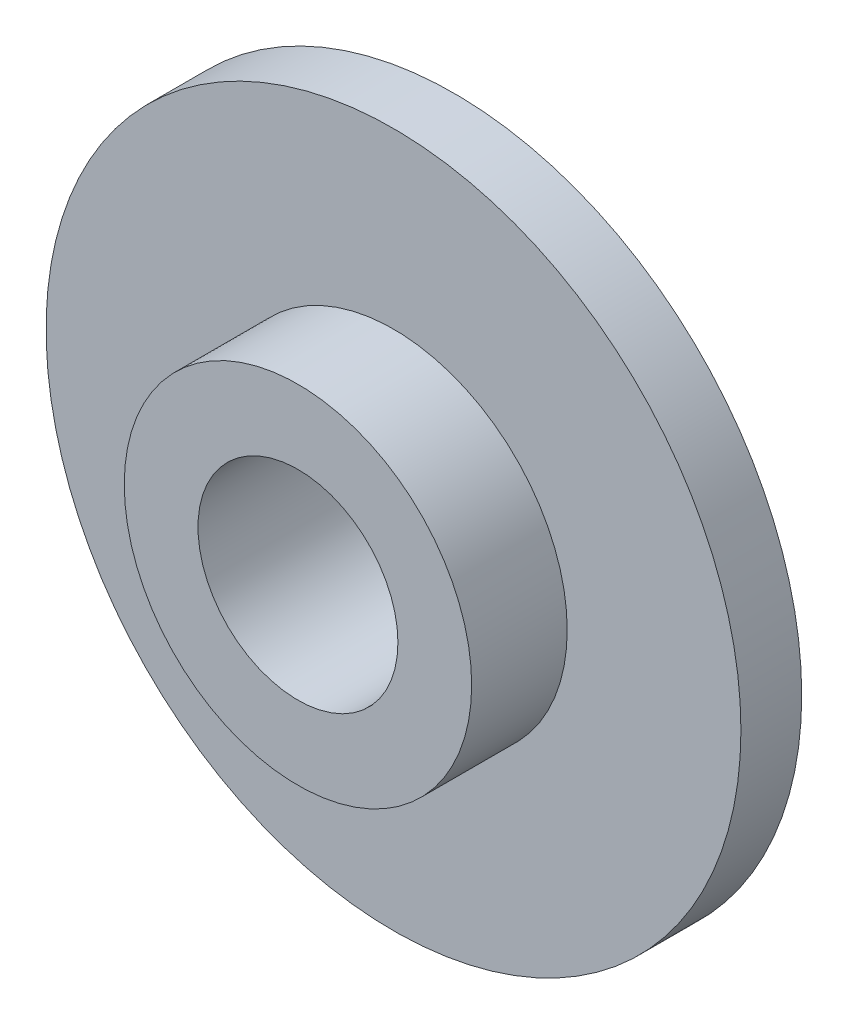
ISO-10303-21;
HEADER;
FILE_DESCRIPTION(('STEP AP214'),'2;1');
FILE_NAME('part.step','',(''),(''),'','','');
FILE_SCHEMA(('AUTOMOTIVE_DESIGN { 1 0 10303 214 1 1 1 1 }'));
ENDSEC;
DATA;
#1=APPLICATION_CONTEXT('core data for automotive mechanical design processes');
#2=APPLICATION_PROTOCOL_DEFINITION('international standard','automotive_design',2000,#1);
#3=PRODUCT_CONTEXT('',#1,'mechanical');
#4=PRODUCT('Part','Part','',(#3));
#5=PRODUCT_RELATED_PRODUCT_CATEGORY('part','',(#4));
#6=PRODUCT_DEFINITION_FORMATION('','',#4);
#7=PRODUCT_DEFINITION_CONTEXT('part definition',#1,'design');
#8=PRODUCT_DEFINITION('design','',#6,#7);
#9=PRODUCT_DEFINITION_SHAPE('','',#8);
#10=(LENGTH_UNIT() NAMED_UNIT(*) SI_UNIT(.MILLI.,.METRE.));
#11=(NAMED_UNIT(*) PLANE_ANGLE_UNIT() SI_UNIT($,.RADIAN.));
#12=(NAMED_UNIT(*) SI_UNIT($,.STERADIAN.) SOLID_ANGLE_UNIT());
#13=UNCERTAINTY_MEASURE_WITH_UNIT(LENGTH_MEASURE(1.E-05),#10,'distance_accuracy_value','');
#14=(GEOMETRIC_REPRESENTATION_CONTEXT(3) GLOBAL_UNCERTAINTY_ASSIGNED_CONTEXT((#13)) GLOBAL_UNIT_ASSIGNED_CONTEXT((#10,
#11,#12)) REPRESENTATION_CONTEXT('',''));
#15=CARTESIAN_POINT('',(0.,0.,0.));
#16=DIRECTION('',(0.,0.,1.));
#17=DIRECTION('',(1.,0.,0.));
#18=AXIS2_PLACEMENT_3D('',#15,#16,#17);
#19=CARTESIAN_POINT('',(0.,0.,1.778));
#20=DIRECTION('',(0.,0.,-1.));
#21=DIRECTION('',(-1.,0.,0.));
#22=AXIS2_PLACEMENT_3D('',#19,#20,#21);
#23=CYLINDRICAL_SURFACE('',#22,10.16);
#24=CARTESIAN_POINT('',(0.,0.,1.778));
#25=DIRECTION('',(0.,0.,1.));
#26=DIRECTION('',(1.,0.,0.));
#27=AXIS2_PLACEMENT_3D('',#24,#25,#26);
#28=CIRCLE('',#27,10.16);
#29=CARTESIAN_POINT('',(10.16,0.,1.778));
#30=VERTEX_POINT('',#29);
#31=EDGE_CURVE('E41',#30,#30,#28,.T.);
#32=ORIENTED_EDGE('',*,*,#31,.F.);
#33=EDGE_LOOP('',(#32));
#34=FACE_BOUND('',#33,.T.);
#35=CARTESIAN_POINT('',(0.,0.,0.));
#36=DIRECTION('',(0.,0.,1.));
#37=DIRECTION('',(1.,0.,0.));
#38=AXIS2_PLACEMENT_3D('',#35,#36,#37);
#39=CIRCLE('',#38,10.16);
#40=CARTESIAN_POINT('',(10.16,0.,0.));
#41=VERTEX_POINT('',#40);
#42=EDGE_CURVE('E37',#41,#41,#39,.T.);
#43=ORIENTED_EDGE('',*,*,#42,.T.);
#44=EDGE_LOOP('',(#43));
#45=FACE_BOUND('',#44,.T.);
#46=ADVANCED_FACE('F34',(#34,#45),#23,.T.);
#47=CARTESIAN_POINT('',(0.,0.,1.778));
#48=DIRECTION('',(0.,0.,1.));
#49=DIRECTION('',(1.,0.,0.));
#50=AXIS2_PLACEMENT_3D('',#47,#48,#49);
#51=PLANE('',#50);
#52=CARTESIAN_POINT('',(0.,0.,1.778));
#53=DIRECTION('',(0.,0.,1.));
#54=DIRECTION('',(1.,0.,0.));
#55=AXIS2_PLACEMENT_3D('',#52,#53,#54);
#56=CIRCLE('',#55,5.08);
#57=CARTESIAN_POINT('',(5.08,0.,1.778));
#58=VERTEX_POINT('',#57);
#59=EDGE_CURVE('E10',#58,#58,#56,.T.);
#60=ORIENTED_EDGE('',*,*,#59,.F.);
#61=EDGE_LOOP('',(#60));
#62=FACE_BOUND('',#61,.T.);
#63=ORIENTED_EDGE('',*,*,#31,.T.);
#64=EDGE_LOOP('',(#63));
#65=FACE_BOUND('',#64,.T.);
#66=ADVANCED_FACE('F78',(#62,#65),#51,.T.);
#67=CARTESIAN_POINT('',(0.,0.,0.));
#68=DIRECTION('',(0.,0.,1.));
#69=DIRECTION('',(1.,0.,0.));
#70=AXIS2_PLACEMENT_3D('',#67,#68,#69);
#71=PLANE('',#70);
#72=CARTESIAN_POINT('',(0.,0.,0.));
#73=DIRECTION('',(0.,0.,1.));
#74=DIRECTION('',(1.,0.,0.));
#75=AXIS2_PLACEMENT_3D('',#72,#73,#74);
#76=CIRCLE('',#75,2.92345749910196);
#77=CARTESIAN_POINT('',(2.92345749910196,0.,0.));
#78=VERTEX_POINT('',#77);
#79=EDGE_CURVE('E50',#78,#78,#76,.T.);
#80=ORIENTED_EDGE('',*,*,#79,.T.);
#81=EDGE_LOOP('',(#80));
#82=FACE_BOUND('',#81,.T.);
#83=ORIENTED_EDGE('',*,*,#42,.F.);
#84=EDGE_LOOP('',(#83));
#85=FACE_BOUND('',#84,.T.);
#86=ADVANCED_FACE('F57',(#82,#85),#71,.F.);
#87=CARTESIAN_POINT('',(0.,0.,4.572));
#88=DIRECTION('',(0.,0.,-1.));
#89=DIRECTION('',(-1.,0.,0.));
#90=AXIS2_PLACEMENT_3D('',#87,#88,#89);
#91=CYLINDRICAL_SURFACE('',#90,5.08);
#92=CARTESIAN_POINT('',(0.,0.,4.572));
#93=DIRECTION('',(0.,0.,1.));
#94=DIRECTION('',(1.,0.,0.));
#95=AXIS2_PLACEMENT_3D('',#92,#93,#94);
#96=CIRCLE('',#95,5.08);
#97=CARTESIAN_POINT('',(5.08,0.,4.572));
#98=VERTEX_POINT('',#97);
#99=EDGE_CURVE('E47',#98,#98,#96,.T.);
#100=ORIENTED_EDGE('',*,*,#99,.F.);
#101=EDGE_LOOP('',(#100));
#102=FACE_BOUND('',#101,.T.);
#103=ORIENTED_EDGE('',*,*,#59,.T.);
#104=EDGE_LOOP('',(#103));
#105=FACE_BOUND('',#104,.T.);
#106=ADVANCED_FACE('F69',(#102,#105),#91,.T.);
#107=CARTESIAN_POINT('',(0.,0.,4.572));
#108=DIRECTION('',(0.,0.,1.));
#109=DIRECTION('',(1.,0.,0.));
#110=AXIS2_PLACEMENT_3D('',#107,#108,#109);
#111=PLANE('',#110);
#112=CARTESIAN_POINT('',(0.,0.,4.572));
#113=DIRECTION('',(0.,0.,1.));
#114=DIRECTION('',(1.,0.,0.));
#115=AXIS2_PLACEMENT_3D('',#112,#113,#114);
#116=CIRCLE('',#115,2.92345749910196);
#117=CARTESIAN_POINT('',(2.92345749910196,0.,4.572));
#118=VERTEX_POINT('',#117);
#119=EDGE_CURVE('E51',#118,#118,#116,.T.);
#120=ORIENTED_EDGE('',*,*,#119,.F.);
#121=EDGE_LOOP('',(#120));
#122=FACE_BOUND('',#121,.T.);
#123=ORIENTED_EDGE('',*,*,#99,.T.);
#124=EDGE_LOOP('',(#123));
#125=FACE_BOUND('',#124,.T.);
#126=ADVANCED_FACE('F63',(#122,#125),#111,.T.);
#127=CARTESIAN_POINT('',(0.,0.,0.));
#128=DIRECTION('',(0.,0.,1.));
#129=DIRECTION('',(1.,0.,0.));
#130=AXIS2_PLACEMENT_3D('',#127,#128,#129);
#131=CYLINDRICAL_SURFACE('',#130,2.92345749910196);
#132=ORIENTED_EDGE('',*,*,#79,.F.);
#133=EDGE_LOOP('',(#132));
#134=FACE_BOUND('',#133,.T.);
#135=ORIENTED_EDGE('',*,*,#119,.T.);
#136=EDGE_LOOP('',(#135));
#137=FACE_BOUND('',#136,.T.);
#138=ADVANCED_FACE('F60',(#134,#137),#131,.F.);
#139=CLOSED_SHELL('',(#46,#66,#86,#106,#126,#138));
#140=MANIFOLD_SOLID_BREP('B2',#139);
#141=ADVANCED_BREP_SHAPE_REPRESENTATION('',(#18,#140),#14);
#142=SHAPE_DEFINITION_REPRESENTATION(#9,#141);
ENDSEC;
END-ISO-10303-21;
